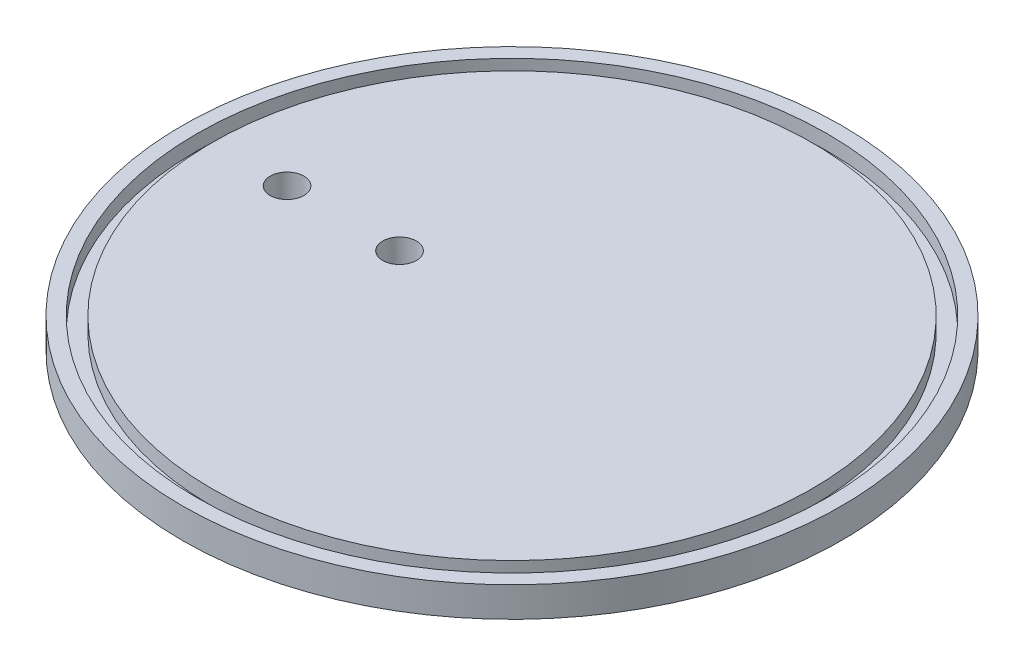
ISO-10303-21;
HEADER;
FILE_DESCRIPTION(('STEP AP214'),'2;1');
FILE_NAME('part.step','',(''),(''),'','','');
FILE_SCHEMA(('AUTOMOTIVE_DESIGN { 1 0 10303 214 1 1 1 1 }'));
ENDSEC;
DATA;
#1=APPLICATION_CONTEXT('core data for automotive mechanical design processes');
#2=APPLICATION_PROTOCOL_DEFINITION('international standard','automotive_design',2000,#1);
#3=PRODUCT_CONTEXT('',#1,'mechanical');
#4=PRODUCT('Part','Part','',(#3));
#5=PRODUCT_RELATED_PRODUCT_CATEGORY('part','',(#4));
#6=PRODUCT_DEFINITION_FORMATION('','',#4);
#7=PRODUCT_DEFINITION_CONTEXT('part definition',#1,'design');
#8=PRODUCT_DEFINITION('design','',#6,#7);
#9=PRODUCT_DEFINITION_SHAPE('','',#8);
#10=(LENGTH_UNIT() NAMED_UNIT(*) SI_UNIT(.MILLI.,.METRE.));
#11=(NAMED_UNIT(*) PLANE_ANGLE_UNIT() SI_UNIT($,.RADIAN.));
#12=(NAMED_UNIT(*) SI_UNIT($,.STERADIAN.) SOLID_ANGLE_UNIT());
#13=UNCERTAINTY_MEASURE_WITH_UNIT(LENGTH_MEASURE(1.E-05),#10,'distance_accuracy_value','');
#14=(GEOMETRIC_REPRESENTATION_CONTEXT(3) GLOBAL_UNCERTAINTY_ASSIGNED_CONTEXT((#13)) GLOBAL_UNIT_ASSIGNED_CONTEXT((#10,
#11,#12)) REPRESENTATION_CONTEXT('',''));
#15=CARTESIAN_POINT('',(0.,0.,0.));
#16=DIRECTION('',(0.,0.,1.));
#17=DIRECTION('',(1.,0.,0.));
#18=AXIS2_PLACEMENT_3D('',#15,#16,#17);
#19=CARTESIAN_POINT('',(0.,-4.,0.));
#20=DIRECTION('',(0.,-1.,0.));
#21=DIRECTION('',(0.,0.,-1.));
#22=AXIS2_PLACEMENT_3D('',#19,#20,#21);
#23=PLANE('',#22);
#24=CARTESIAN_POINT('',(0.,-4.,0.));
#25=DIRECTION('',(0.,1.,0.));
#26=DIRECTION('',(0.,0.,1.));
#27=AXIS2_PLACEMENT_3D('',#24,#25,#26);
#28=CIRCLE('',#27,43.9517041548704);
#29=CARTESIAN_POINT('',(0.,-4.,43.9517041548704));
#30=VERTEX_POINT('',#29);
#31=EDGE_CURVE('E11',#30,#30,#28,.T.);
#32=ORIENTED_EDGE('',*,*,#31,.F.);
#33=EDGE_LOOP('',(#32));
#34=FACE_BOUND('',#33,.T.);
#35=DIRECTION('',(0.,0.,1.));
#36=VECTOR('',#35,1.);
#37=CARTESIAN_POINT('',(5.,-4.,-10.));
#38=LINE('',#37,#36);
#39=CARTESIAN_POINT('',(4.99999999999999,-4.,-10.));
#40=VERTEX_POINT('',#39);
#41=CARTESIAN_POINT('',(5.,-4.,10.));
#42=VERTEX_POINT('',#41);
#43=EDGE_CURVE('E63',#40,#42,#38,.T.);
#44=ORIENTED_EDGE('',*,*,#43,.F.);
#45=DIRECTION('',(-1.,0.,0.));
#46=VECTOR('',#45,1.);
#47=CARTESIAN_POINT('',(0.,-4.,-10.));
#48=LINE('',#47,#46);
#49=CARTESIAN_POINT('',(-35.,-4.,-10.));
#50=VERTEX_POINT('',#49);
#51=EDGE_CURVE('E68',#40,#50,#48,.T.);
#52=ORIENTED_EDGE('',*,*,#51,.T.);
#53=DIRECTION('',(0.,0.,1.));
#54=VECTOR('',#53,1.);
#55=CARTESIAN_POINT('',(-35.,-4.00000000000001,-10.));
#56=LINE('',#55,#54);
#57=CARTESIAN_POINT('',(-35.,-4.00000000000001,10.));
#58=VERTEX_POINT('',#57);
#59=EDGE_CURVE('E85',#50,#58,#56,.T.);
#60=ORIENTED_EDGE('',*,*,#59,.T.);
#61=DIRECTION('',(-1.,0.,0.));
#62=VECTOR('',#61,1.);
#63=CARTESIAN_POINT('',(0.,-4.,10.));
#64=LINE('',#63,#62);
#65=EDGE_CURVE('E87',#42,#58,#64,.T.);
#66=ORIENTED_EDGE('',*,*,#65,.F.);
#67=EDGE_LOOP('',(#44,#52,#60,#66));
#68=FACE_BOUND('',#67,.T.);
#69=ADVANCED_FACE('F47',(#34,#68),#23,.T.);
#70=CARTESIAN_POINT('',(0.,100.,0.));
#71=DIRECTION('',(0.,1.,0.));
#72=DIRECTION('',(0.,0.,1.));
#73=AXIS2_PLACEMENT_3D('',#70,#71,#72);
#74=CYLINDRICAL_SURFACE('',#73,43.9517041548704);
#75=ORIENTED_EDGE('',*,*,#31,.T.);
#76=EDGE_LOOP('',(#75));
#77=FACE_BOUND('',#76,.T.);
#78=CARTESIAN_POINT('',(0.,0.,0.));
#79=DIRECTION('',(0.,1.,0.));
#80=DIRECTION('',(0.,0.,1.));
#81=AXIS2_PLACEMENT_3D('',#78,#79,#80);
#82=CIRCLE('',#81,43.9517041548704);
#83=CARTESIAN_POINT('',(0.,0.,43.9517041548704));
#84=VERTEX_POINT('',#83);
#85=EDGE_CURVE('E158',#84,#84,#82,.T.);
#86=ORIENTED_EDGE('',*,*,#85,.F.);
#87=EDGE_LOOP('',(#86));
#88=FACE_BOUND('',#87,.T.);
#89=ADVANCED_FACE('F49',(#77,#88),#74,.T.);
#90=CARTESIAN_POINT('',(0.,0.,0.));
#91=DIRECTION('',(0.,-1.,0.));
#92=DIRECTION('',(0.,0.,-1.));
#93=AXIS2_PLACEMENT_3D('',#90,#91,#92);
#94=PLANE('',#93);
#95=CARTESIAN_POINT('',(-30.,0.,0.));
#96=DIRECTION('',(0.,-1.,0.));
#97=DIRECTION('',(0.,0.,-1.));
#98=AXIS2_PLACEMENT_3D('',#95,#96,#97);
#99=CIRCLE('',#98,2.25);
#100=CARTESIAN_POINT('',(-30.,0.,-2.25));
#101=VERTEX_POINT('',#100);
#102=EDGE_CURVE('E202',#101,#101,#99,.T.);
#103=ORIENTED_EDGE('',*,*,#102,.T.);
#104=EDGE_LOOP('',(#103));
#105=FACE_BOUND('',#104,.T.);
#106=CARTESIAN_POINT('',(-15.,0.,0.));
#107=DIRECTION('',(0.,-1.,0.));
#108=DIRECTION('',(0.,0.,-1.));
#109=AXIS2_PLACEMENT_3D('',#106,#107,#108);
#110=CIRCLE('',#109,2.25);
#111=CARTESIAN_POINT('',(-15.,0.,-2.25));
#112=VERTEX_POINT('',#111);
#113=EDGE_CURVE('E205',#112,#112,#110,.T.);
#114=ORIENTED_EDGE('',*,*,#113,.T.);
#115=EDGE_LOOP('',(#114));
#116=FACE_BOUND('',#115,.T.);
#117=CARTESIAN_POINT('',(0.,0.,0.));
#118=DIRECTION('',(0.,1.,0.));
#119=DIRECTION('',(0.,0.,1.));
#120=AXIS2_PLACEMENT_3D('',#117,#118,#119);
#121=CIRCLE('',#120,40.);
#122=CARTESIAN_POINT('',(0.,0.,40.));
#123=VERTEX_POINT('',#122);
#124=EDGE_CURVE('E56',#123,#123,#121,.T.);
#125=ORIENTED_EDGE('',*,*,#124,.T.);
#126=EDGE_LOOP('',(#125));
#127=FACE_BOUND('',#126,.T.);
#128=ADVANCED_FACE('F144',(#105,#116,#127),#94,.F.);
#129=CARTESIAN_POINT('',(0.,100.,0.));
#130=DIRECTION('',(0.,1.,0.));
#131=DIRECTION('',(0.,0.,1.));
#132=AXIS2_PLACEMENT_3D('',#129,#130,#131);
#133=CYLINDRICAL_SURFACE('',#132,40.);
#134=CARTESIAN_POINT('',(0.,-2.,0.));
#135=DIRECTION('',(0.,1.,0.));
#136=DIRECTION('',(0.,0.,1.));
#137=AXIS2_PLACEMENT_3D('',#134,#135,#136);
#138=CIRCLE('',#137,40.);
#139=CARTESIAN_POINT('',(0.,-2.,40.));
#140=VERTEX_POINT('',#139);
#141=EDGE_CURVE('E174',#140,#140,#138,.T.);
#142=ORIENTED_EDGE('',*,*,#141,.T.);
#143=EDGE_LOOP('',(#142));
#144=FACE_BOUND('',#143,.T.);
#145=ORIENTED_EDGE('',*,*,#124,.F.);
#146=EDGE_LOOP('',(#145));
#147=FACE_BOUND('',#146,.T.);
#148=ADVANCED_FACE('F140',(#144,#147),#133,.T.);
#149=CARTESIAN_POINT('',(0.,-2.,0.));
#150=DIRECTION('',(0.,1.,0.));
#151=DIRECTION('',(0.,0.,1.));
#152=AXIS2_PLACEMENT_3D('',#149,#150,#151);
#153=PLANE('',#152);
#154=CARTESIAN_POINT('',(0.,-2.,0.));
#155=DIRECTION('',(0.,1.,0.));
#156=DIRECTION('',(0.,0.,1.));
#157=AXIS2_PLACEMENT_3D('',#154,#155,#156);
#158=CIRCLE('',#157,42.0396078054371);
#159=CARTESIAN_POINT('',(0.,-2.,42.0396078054371));
#160=VERTEX_POINT('',#159);
#161=EDGE_CURVE('E166',#160,#160,#158,.T.);
#162=ORIENTED_EDGE('',*,*,#161,.T.);
#163=EDGE_LOOP('',(#162));
#164=FACE_BOUND('',#163,.T.);
#165=ORIENTED_EDGE('',*,*,#141,.F.);
#166=EDGE_LOOP('',(#165));
#167=FACE_BOUND('',#166,.T.);
#168=ADVANCED_FACE('F136',(#164,#167),#153,.T.);
#169=CARTESIAN_POINT('',(0.,100.,0.));
#170=DIRECTION('',(0.,1.,0.));
#171=DIRECTION('',(0.,0.,1.));
#172=AXIS2_PLACEMENT_3D('',#169,#170,#171);
#173=CYLINDRICAL_SURFACE('',#172,42.0396078054371);
#174=ORIENTED_EDGE('',*,*,#161,.F.);
#175=EDGE_LOOP('',(#174));
#176=FACE_BOUND('',#175,.T.);
#177=CARTESIAN_POINT('',(0.,0.,0.));
#178=DIRECTION('',(0.,1.,0.));
#179=DIRECTION('',(0.,0.,1.));
#180=AXIS2_PLACEMENT_3D('',#177,#178,#179);
#181=CIRCLE('',#180,42.0396078054371);
#182=CARTESIAN_POINT('',(0.,0.,42.0396078054371));
#183=VERTEX_POINT('',#182);
#184=EDGE_CURVE('E160',#183,#183,#181,.T.);
#185=ORIENTED_EDGE('',*,*,#184,.T.);
#186=EDGE_LOOP('',(#185));
#187=FACE_BOUND('',#186,.T.);
#188=ADVANCED_FACE('F132',(#176,#187),#173,.F.);
#189=CARTESIAN_POINT('',(0.,0.,0.));
#190=DIRECTION('',(0.,1.,0.));
#191=DIRECTION('',(0.,0.,1.));
#192=AXIS2_PLACEMENT_3D('',#189,#190,#191);
#193=PLANE('',#192);
#194=ORIENTED_EDGE('',*,*,#85,.T.);
#195=EDGE_LOOP('',(#194));
#196=FACE_BOUND('',#195,.T.);
#197=ORIENTED_EDGE('',*,*,#184,.F.);
#198=EDGE_LOOP('',(#197));
#199=FACE_BOUND('',#198,.T.);
#200=ADVANCED_FACE('F127',(#196,#199),#193,.T.);
#201=CARTESIAN_POINT('',(4.99999999999999,-15.35,-10.));
#202=DIRECTION('',(0.,0.,1.));
#203=DIRECTION('',(-1.,0.,0.));
#204=AXIS2_PLACEMENT_3D('',#201,#202,#203);
#205=ELLIPSE('',#204,15.,11.35);
#206=DIRECTION('',(0.,0.,1.));
#207=VECTOR('',#206,1.);
#208=SURFACE_OF_LINEAR_EXTRUSION('',#205,#207);
#209=ORIENTED_EDGE('',*,*,#43,.T.);
#210=CARTESIAN_POINT('',(4.99999999999999,-15.35,10.));
#211=DIRECTION('',(0.,0.,1.));
#212=DIRECTION('',(-1.,0.,0.));
#213=AXIS2_PLACEMENT_3D('',#210,#211,#212);
#214=ELLIPSE('',#213,15.,11.35);
#215=CARTESIAN_POINT('',(-7.43274519089877,-9.00000000000001,10.));
#216=VERTEX_POINT('',#215);
#217=EDGE_CURVE('E103',#42,#216,#214,.T.);
#218=ORIENTED_EDGE('',*,*,#217,.T.);
#219=DIRECTION('',(0.,0.,1.));
#220=VECTOR('',#219,1.);
#221=CARTESIAN_POINT('',(-7.43274519089877,-9.00000000000001,-10.));
#222=LINE('',#221,#220);
#223=CARTESIAN_POINT('',(-7.43274519089877,-9.00000000000001,-10.));
#224=VERTEX_POINT('',#223);
#225=EDGE_CURVE('E161',#224,#216,#222,.T.);
#226=ORIENTED_EDGE('',*,*,#225,.F.);
#227=EDGE_CURVE('E112',#40,#224,#205,.T.);
#228=ORIENTED_EDGE('',*,*,#227,.F.);
#229=EDGE_LOOP('',(#209,#218,#226,#228));
#230=FACE_BOUND('',#229,.T.);
#231=ADVANCED_FACE('F122',(#230),#208,.F.);
#232=CARTESIAN_POINT('',(0.,-9.,-10.));
#233=DIRECTION('',(0.,1.,0.));
#234=DIRECTION('',(-1.,0.,0.));
#235=AXIS2_PLACEMENT_3D('',#232,#233,#234);
#236=PLANE('',#235);
#237=CARTESIAN_POINT('',(-30.,-9.00000000000001,0.));
#238=DIRECTION('',(0.,-1.,0.));
#239=DIRECTION('',(1.,0.,0.));
#240=AXIS2_PLACEMENT_3D('',#237,#238,#239);
#241=CIRCLE('',#240,2.25);
#242=CARTESIAN_POINT('',(-27.75,-9.00000000000001,0.));
#243=VERTEX_POINT('',#242);
#244=EDGE_CURVE('E211',#243,#243,#241,.T.);
#245=ORIENTED_EDGE('',*,*,#244,.F.);
#246=EDGE_LOOP('',(#245));
#247=FACE_BOUND('',#246,.T.);
#248=CARTESIAN_POINT('',(-15.,-9.00000000000001,0.));
#249=DIRECTION('',(0.,-1.,0.));
#250=DIRECTION('',(1.,0.,0.));
#251=AXIS2_PLACEMENT_3D('',#248,#249,#250);
#252=CIRCLE('',#251,2.25);
#253=CARTESIAN_POINT('',(-12.75,-9.00000000000001,0.));
#254=VERTEX_POINT('',#253);
#255=EDGE_CURVE('E212',#254,#254,#252,.T.);
#256=ORIENTED_EDGE('',*,*,#255,.F.);
#257=EDGE_LOOP('',(#256));
#258=FACE_BOUND('',#257,.T.);
#259=ORIENTED_EDGE('',*,*,#225,.T.);
#260=DIRECTION('',(-1.,0.,0.));
#261=VECTOR('',#260,1.);
#262=CARTESIAN_POINT('',(0.,-9.,10.));
#263=LINE('',#262,#261);
#264=CARTESIAN_POINT('',(-35.,-9.00000000000001,10.));
#265=VERTEX_POINT('',#264);
#266=EDGE_CURVE('E109',#216,#265,#263,.T.);
#267=ORIENTED_EDGE('',*,*,#266,.T.);
#268=DIRECTION('',(0.,0.,1.));
#269=VECTOR('',#268,1.);
#270=CARTESIAN_POINT('',(-35.,-9.00000000000001,-10.));
#271=LINE('',#270,#269);
#272=CARTESIAN_POINT('',(-35.,-9.00000000000001,-10.));
#273=VERTEX_POINT('',#272);
#274=EDGE_CURVE('E93',#273,#265,#271,.T.);
#275=ORIENTED_EDGE('',*,*,#274,.F.);
#276=DIRECTION('',(-1.,0.,0.));
#277=VECTOR('',#276,1.);
#278=CARTESIAN_POINT('',(0.,-9.,-10.));
#279=LINE('',#278,#277);
#280=EDGE_CURVE('E189',#224,#273,#279,.T.);
#281=ORIENTED_EDGE('',*,*,#280,.F.);
#282=EDGE_LOOP('',(#259,#267,#275,#281));
#283=FACE_BOUND('',#282,.T.);
#284=ADVANCED_FACE('F126',(#247,#258,#283),#236,.F.);
#285=CARTESIAN_POINT('',(-35.,0.,-10.));
#286=DIRECTION('',(-1.,0.,0.));
#287=DIRECTION('',(0.,0.,1.));
#288=AXIS2_PLACEMENT_3D('',#285,#286,#287);
#289=PLANE('',#288);
#290=ORIENTED_EDGE('',*,*,#274,.T.);
#291=DIRECTION('',(0.,-1.,0.));
#292=VECTOR('',#291,1.);
#293=CARTESIAN_POINT('',(-35.,0.,10.));
#294=LINE('',#293,#292);
#295=EDGE_CURVE('E100',#58,#265,#294,.T.);
#296=ORIENTED_EDGE('',*,*,#295,.F.);
#297=ORIENTED_EDGE('',*,*,#59,.F.);
#298=DIRECTION('',(0.,-1.,0.));
#299=VECTOR('',#298,1.);
#300=CARTESIAN_POINT('',(-35.,0.,-10.));
#301=LINE('',#300,#299);
#302=EDGE_CURVE('E194',#50,#273,#301,.T.);
#303=ORIENTED_EDGE('',*,*,#302,.T.);
#304=EDGE_LOOP('',(#290,#296,#297,#303));
#305=FACE_BOUND('',#304,.T.);
#306=ADVANCED_FACE('F106',(#305),#289,.T.);
#307=CARTESIAN_POINT('',(0.,0.,-10.));
#308=DIRECTION('',(0.,0.,1.));
#309=DIRECTION('',(1.,0.,0.));
#310=AXIS2_PLACEMENT_3D('',#307,#308,#309);
#311=PLANE('',#310);
#312=ORIENTED_EDGE('',*,*,#227,.T.);
#313=ORIENTED_EDGE('',*,*,#280,.T.);
#314=ORIENTED_EDGE('',*,*,#302,.F.);
#315=ORIENTED_EDGE('',*,*,#51,.F.);
#316=EDGE_LOOP('',(#312,#313,#314,#315));
#317=FACE_BOUND('',#316,.T.);
#318=ADVANCED_FACE('F198',(#317),#311,.F.);
#319=CARTESIAN_POINT('',(0.,0.,10.));
#320=DIRECTION('',(0.,0.,1.));
#321=DIRECTION('',(1.,0.,0.));
#322=AXIS2_PLACEMENT_3D('',#319,#320,#321);
#323=PLANE('',#322);
#324=ORIENTED_EDGE('',*,*,#217,.F.);
#325=ORIENTED_EDGE('',*,*,#65,.T.);
#326=ORIENTED_EDGE('',*,*,#295,.T.);
#327=ORIENTED_EDGE('',*,*,#266,.F.);
#328=EDGE_LOOP('',(#324,#325,#326,#327));
#329=FACE_BOUND('',#328,.T.);
#330=ADVANCED_FACE('F98',(#329),#323,.T.);
#331=CARTESIAN_POINT('',(-15.,7.,0.));
#332=DIRECTION('',(0.,-1.,0.));
#333=DIRECTION('',(1.,0.,0.));
#334=AXIS2_PLACEMENT_3D('',#331,#332,#333);
#335=CYLINDRICAL_SURFACE('',#334,2.25);
#336=ORIENTED_EDGE('',*,*,#255,.T.);
#337=EDGE_LOOP('',(#336));
#338=FACE_BOUND('',#337,.T.);
#339=ORIENTED_EDGE('',*,*,#113,.F.);
#340=EDGE_LOOP('',(#339));
#341=FACE_BOUND('',#340,.T.);
#342=ADVANCED_FACE('F227',(#338,#341),#335,.F.);
#343=CARTESIAN_POINT('',(-30.,6.99999999999999,0.));
#344=DIRECTION('',(0.,-1.,0.));
#345=DIRECTION('',(1.,0.,0.));
#346=AXIS2_PLACEMENT_3D('',#343,#344,#345);
#347=CYLINDRICAL_SURFACE('',#346,2.25);
#348=ORIENTED_EDGE('',*,*,#244,.T.);
#349=EDGE_LOOP('',(#348));
#350=FACE_BOUND('',#349,.T.);
#351=ORIENTED_EDGE('',*,*,#102,.F.);
#352=EDGE_LOOP('',(#351));
#353=FACE_BOUND('',#352,.T.);
#354=ADVANCED_FACE('F220',(#350,#353),#347,.F.);
#355=CLOSED_SHELL('',(#69,#89,#128,#148,#168,#188,#200,#231,#284,#306,#318,#330,#342,#354));
#356=MANIFOLD_SOLID_BREP('B2',#355);
#357=ADVANCED_BREP_SHAPE_REPRESENTATION('',(#18,#356),#14);
#358=SHAPE_DEFINITION_REPRESENTATION(#9,#357);
ENDSEC;
END-ISO-10303-21;
